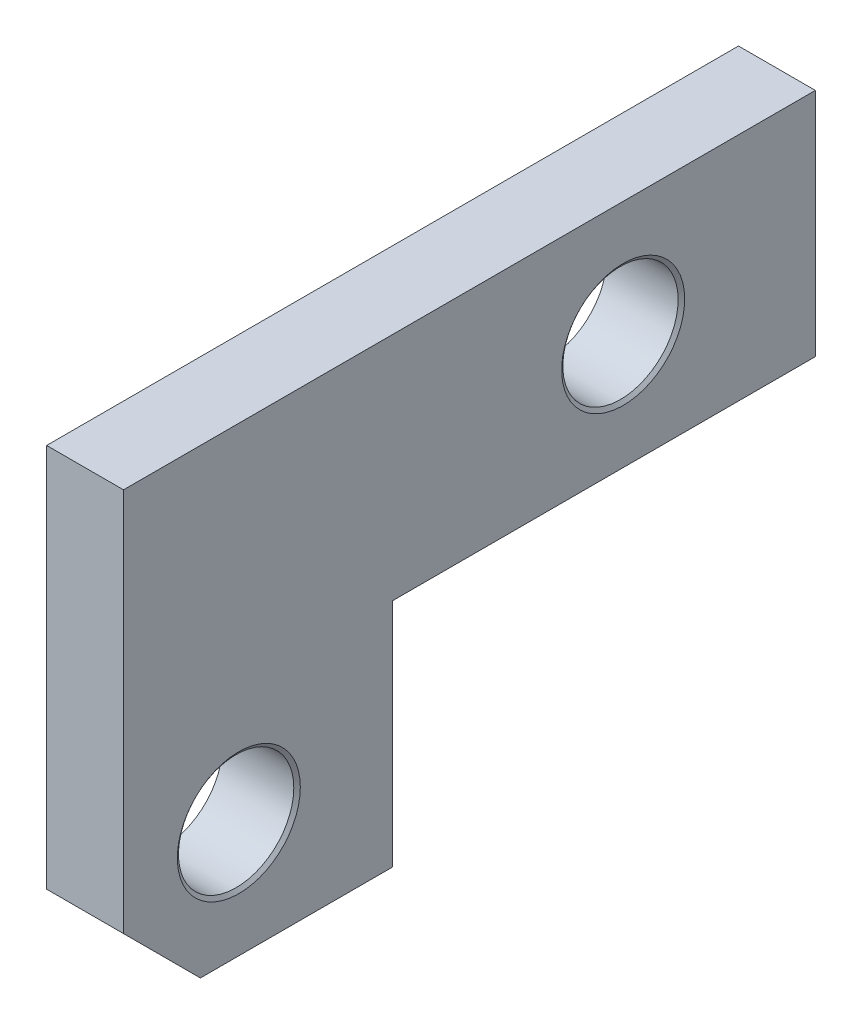
ISO-10303-21;
HEADER;
FILE_DESCRIPTION(('STEP AP214'),'2;1');
FILE_NAME('part.step','',(''),(''),'','','');
FILE_SCHEMA(('AUTOMOTIVE_DESIGN { 1 0 10303 214 1 1 1 1 }'));
ENDSEC;
DATA;
#1=APPLICATION_CONTEXT('core data for automotive mechanical design processes');
#2=APPLICATION_PROTOCOL_DEFINITION('international standard','automotive_design',2000,#1);
#3=PRODUCT_CONTEXT('',#1,'mechanical');
#4=PRODUCT('Part','Part','',(#3));
#5=PRODUCT_RELATED_PRODUCT_CATEGORY('part','',(#4));
#6=PRODUCT_DEFINITION_FORMATION('','',#4);
#7=PRODUCT_DEFINITION_CONTEXT('part definition',#1,'design');
#8=PRODUCT_DEFINITION('design','',#6,#7);
#9=PRODUCT_DEFINITION_SHAPE('','',#8);
#10=(LENGTH_UNIT() NAMED_UNIT(*) SI_UNIT(.MILLI.,.METRE.));
#11=(NAMED_UNIT(*) PLANE_ANGLE_UNIT() SI_UNIT($,.RADIAN.));
#12=(NAMED_UNIT(*) SI_UNIT($,.STERADIAN.) SOLID_ANGLE_UNIT());
#13=UNCERTAINTY_MEASURE_WITH_UNIT(LENGTH_MEASURE(1.E-05),#10,'distance_accuracy_value','');
#14=(GEOMETRIC_REPRESENTATION_CONTEXT(3) GLOBAL_UNCERTAINTY_ASSIGNED_CONTEXT((#13)) GLOBAL_UNIT_ASSIGNED_CONTEXT((#10,
#11,#12)) REPRESENTATION_CONTEXT('',''));
#15=CARTESIAN_POINT('',(0.,0.,0.));
#16=DIRECTION('',(0.,0.,1.));
#17=DIRECTION('',(1.,0.,0.));
#18=AXIS2_PLACEMENT_3D('',#15,#16,#17);
#19=CARTESIAN_POINT('',(2.,0.,2.));
#20=DIRECTION('',(0.,0.,1.));
#21=DIRECTION('',(0.,-1.,0.));
#22=AXIS2_PLACEMENT_3D('',#19,#20,#21);
#23=PLANE('',#22);
#24=DIRECTION('',(0.,1.,0.));
#25=VECTOR('',#24,1.);
#26=CARTESIAN_POINT('',(0.,0.,2.));
#27=LINE('',#26,#25);
#28=CARTESIAN_POINT('',(0.,-6.,2.));
#29=VERTEX_POINT('',#28);
#30=CARTESIAN_POINT('',(0.,0.,2.));
#31=VERTEX_POINT('',#30);
#32=EDGE_CURVE('E111',#29,#31,#27,.T.);
#33=ORIENTED_EDGE('',*,*,#32,.T.);
#34=DIRECTION('',(-1.,0.,0.));
#35=VECTOR('',#34,1.);
#36=CARTESIAN_POINT('',(2.,0.,2.));
#37=LINE('',#36,#35);
#38=CARTESIAN_POINT('',(2.,0.,2.));
#39=VERTEX_POINT('',#38);
#40=EDGE_CURVE('E92',#39,#31,#37,.T.);
#41=ORIENTED_EDGE('',*,*,#40,.F.);
#42=DIRECTION('',(0.,1.,0.));
#43=VECTOR('',#42,1.);
#44=CARTESIAN_POINT('',(2.,0.,2.));
#45=LINE('',#44,#43);
#46=CARTESIAN_POINT('',(2.,-6.,2.));
#47=VERTEX_POINT('',#46);
#48=EDGE_CURVE('E99',#47,#39,#45,.T.);
#49=ORIENTED_EDGE('',*,*,#48,.F.);
#50=DIRECTION('',(-1.,0.,0.));
#51=VECTOR('',#50,1.);
#52=CARTESIAN_POINT('',(2.,-6.,2.));
#53=LINE('',#52,#51);
#54=EDGE_CURVE('E124',#47,#29,#53,.T.);
#55=ORIENTED_EDGE('',*,*,#54,.T.);
#56=EDGE_LOOP('',(#33,#41,#49,#55));
#57=FACE_BOUND('',#56,.T.);
#58=ADVANCED_FACE('F31',(#57),#23,.F.);
#59=CARTESIAN_POINT('',(2.,-1.66533453693773E-13,-16.9681857510935));
#60=DIRECTION('',(0.,1.,0.));
#61=DIRECTION('',(0.,0.,1.));
#62=AXIS2_PLACEMENT_3D('',#59,#60,#61);
#63=PLANE('',#62);
#64=DIRECTION('',(0.,0.,-1.));
#65=VECTOR('',#64,1.);
#66=CARTESIAN_POINT('',(0.,-1.66533453693773E-13,-16.9681857510935));
#67=LINE('',#66,#65);
#68=CARTESIAN_POINT('',(0.,-1.66533453693773E-13,-9.));
#69=VERTEX_POINT('',#68);
#70=EDGE_CURVE('E135',#31,#69,#67,.T.);
#71=ORIENTED_EDGE('',*,*,#70,.T.);
#72=DIRECTION('',(-1.,0.,0.));
#73=VECTOR('',#72,1.);
#74=CARTESIAN_POINT('',(2.,-1.66533453693773E-13,-9.));
#75=LINE('',#74,#73);
#76=CARTESIAN_POINT('',(2.,-1.66533453693773E-13,-9.));
#77=VERTEX_POINT('',#76);
#78=EDGE_CURVE('E95',#77,#69,#75,.T.);
#79=ORIENTED_EDGE('',*,*,#78,.F.);
#80=DIRECTION('',(0.,0.,-1.));
#81=VECTOR('',#80,1.);
#82=CARTESIAN_POINT('',(2.,-1.66533453693773E-13,-16.9681857510935));
#83=LINE('',#82,#81);
#84=EDGE_CURVE('E88',#39,#77,#83,.T.);
#85=ORIENTED_EDGE('',*,*,#84,.F.);
#86=ORIENTED_EDGE('',*,*,#40,.T.);
#87=EDGE_LOOP('',(#71,#79,#85,#86));
#88=FACE_BOUND('',#87,.T.);
#89=ADVANCED_FACE('F90',(#88),#63,.F.);
#90=CARTESIAN_POINT('',(2.,-1.66533453693773E-13,-9.));
#91=DIRECTION('',(0.,0.,1.));
#92=DIRECTION('',(0.,-1.,0.));
#93=AXIS2_PLACEMENT_3D('',#90,#91,#92);
#94=PLANE('',#93);
#95=DIRECTION('',(0.,1.,0.));
#96=VECTOR('',#95,1.);
#97=CARTESIAN_POINT('',(0.,-1.66533453693773E-13,-9.));
#98=LINE('',#97,#96);
#99=CARTESIAN_POINT('',(0.,6.,-9.));
#100=VERTEX_POINT('',#99);
#101=EDGE_CURVE('E132',#69,#100,#98,.T.);
#102=ORIENTED_EDGE('',*,*,#101,.T.);
#103=DIRECTION('',(-1.,0.,0.));
#104=VECTOR('',#103,1.);
#105=CARTESIAN_POINT('',(2.,6.,-9.));
#106=LINE('',#105,#104);
#107=CARTESIAN_POINT('',(2.,6.,-9.));
#108=VERTEX_POINT('',#107);
#109=EDGE_CURVE('E116',#108,#100,#106,.T.);
#110=ORIENTED_EDGE('',*,*,#109,.F.);
#111=DIRECTION('',(0.,1.,0.));
#112=VECTOR('',#111,1.);
#113=CARTESIAN_POINT('',(2.,-1.66533453693773E-13,-9.));
#114=LINE('',#113,#112);
#115=EDGE_CURVE('E98',#77,#108,#114,.T.);
#116=ORIENTED_EDGE('',*,*,#115,.F.);
#117=ORIENTED_EDGE('',*,*,#78,.T.);
#118=EDGE_LOOP('',(#102,#110,#116,#117));
#119=FACE_BOUND('',#118,.T.);
#120=ADVANCED_FACE('F213',(#119),#94,.F.);
#121=CARTESIAN_POINT('',(2.,6.,-16.9681857510935));
#122=DIRECTION('',(0.,1.,0.));
#123=DIRECTION('',(0.,0.,1.));
#124=AXIS2_PLACEMENT_3D('',#121,#122,#123);
#125=PLANE('',#124);
#126=DIRECTION('',(0.,0.,-1.));
#127=VECTOR('',#126,1.);
#128=CARTESIAN_POINT('',(0.,6.,-16.9681857510935));
#129=LINE('',#128,#127);
#130=CARTESIAN_POINT('',(0.,6.,9.));
#131=VERTEX_POINT('',#130);
#132=EDGE_CURVE('E129',#131,#100,#129,.T.);
#133=ORIENTED_EDGE('',*,*,#132,.F.);
#134=DIRECTION('',(-1.,0.,0.));
#135=VECTOR('',#134,1.);
#136=CARTESIAN_POINT('',(2.,6.,9.));
#137=LINE('',#136,#135);
#138=CARTESIAN_POINT('',(2.,6.,9.));
#139=VERTEX_POINT('',#138);
#140=EDGE_CURVE('E121',#139,#131,#137,.T.);
#141=ORIENTED_EDGE('',*,*,#140,.F.);
#142=DIRECTION('',(0.,0.,-1.));
#143=VECTOR('',#142,1.);
#144=CARTESIAN_POINT('',(2.,6.,-16.9681857510935));
#145=LINE('',#144,#143);
#146=EDGE_CURVE('E142',#139,#108,#145,.T.);
#147=ORIENTED_EDGE('',*,*,#146,.T.);
#148=ORIENTED_EDGE('',*,*,#109,.T.);
#149=EDGE_LOOP('',(#133,#141,#147,#148));
#150=FACE_BOUND('',#149,.T.);
#151=ADVANCED_FACE('F218',(#150),#125,.T.);
#152=CARTESIAN_POINT('',(2.,0.,9.));
#153=DIRECTION('',(0.,0.,1.));
#154=DIRECTION('',(0.,-1.,0.));
#155=AXIS2_PLACEMENT_3D('',#152,#153,#154);
#156=PLANE('',#155);
#157=DIRECTION('',(0.,1.,0.));
#158=VECTOR('',#157,1.);
#159=CARTESIAN_POINT('',(0.,0.,9.));
#160=LINE('',#159,#158);
#161=CARTESIAN_POINT('',(0.,-4.00000000000004,8.99999999999997));
#162=VERTEX_POINT('',#161);
#163=EDGE_CURVE('E127',#162,#131,#160,.T.);
#164=ORIENTED_EDGE('',*,*,#163,.F.);
#165=DIRECTION('',(1.,0.,0.));
#166=VECTOR('',#165,1.);
#167=CARTESIAN_POINT('',(2.,-4.00000000000004,8.99999999999997));
#168=LINE('',#167,#166);
#169=CARTESIAN_POINT('',(2.,-4.00000000000003,8.99999999999997));
#170=VERTEX_POINT('',#169);
#171=EDGE_CURVE('E39',#162,#170,#168,.T.);
#172=ORIENTED_EDGE('',*,*,#171,.T.);
#173=DIRECTION('',(0.,1.,0.));
#174=VECTOR('',#173,1.);
#175=CARTESIAN_POINT('',(2.,0.,9.));
#176=LINE('',#175,#174);
#177=EDGE_CURVE('E140',#170,#139,#176,.T.);
#178=ORIENTED_EDGE('',*,*,#177,.T.);
#179=ORIENTED_EDGE('',*,*,#140,.T.);
#180=EDGE_LOOP('',(#164,#172,#178,#179));
#181=FACE_BOUND('',#180,.T.);
#182=ADVANCED_FACE('F222',(#181),#156,.T.);
#183=CARTESIAN_POINT('',(2.,-6.00000000000017,-16.9681857510935));
#184=DIRECTION('',(0.,1.,0.));
#185=DIRECTION('',(0.,0.,1.));
#186=AXIS2_PLACEMENT_3D('',#183,#184,#185);
#187=PLANE('',#186);
#188=DIRECTION('',(0.,0.,-1.));
#189=VECTOR('',#188,1.);
#190=CARTESIAN_POINT('',(2.,-6.00000000000017,-16.9681857510935));
#191=LINE('',#190,#189);
#192=CARTESIAN_POINT('',(2.,-5.99999999999998,7.));
#193=VERTEX_POINT('',#192);
#194=EDGE_CURVE('E104',#193,#47,#191,.T.);
#195=ORIENTED_EDGE('',*,*,#194,.F.);
#196=DIRECTION('',(-1.,0.,0.));
#197=VECTOR('',#196,1.);
#198=CARTESIAN_POINT('',(0.,-5.99999999999998,7.00000000000001));
#199=LINE('',#198,#197);
#200=CARTESIAN_POINT('',(0.,-5.99999999999998,7.));
#201=VERTEX_POINT('',#200);
#202=EDGE_CURVE('E112',#193,#201,#199,.T.);
#203=ORIENTED_EDGE('',*,*,#202,.T.);
#204=DIRECTION('',(0.,0.,-1.));
#205=VECTOR('',#204,1.);
#206=CARTESIAN_POINT('',(0.,-6.00000000000017,-16.9681857510935));
#207=LINE('',#206,#205);
#208=EDGE_CURVE('E108',#201,#29,#207,.T.);
#209=ORIENTED_EDGE('',*,*,#208,.T.);
#210=ORIENTED_EDGE('',*,*,#54,.F.);
#211=EDGE_LOOP('',(#195,#203,#209,#210));
#212=FACE_BOUND('',#211,.T.);
#213=ADVANCED_FACE('F194',(#212),#187,.F.);
#214=CARTESIAN_POINT('',(2.,-1.66533453693773E-13,-16.9681857510935));
#215=DIRECTION('',(1.,0.,0.));
#216=DIRECTION('',(0.,0.,-1.));
#217=AXIS2_PLACEMENT_3D('',#214,#215,#216);
#218=PLANE('',#217);
#219=CARTESIAN_POINT('',(2.,3.,-4.));
#220=DIRECTION('',(1.,0.,0.));
#221=DIRECTION('',(0.,0.,-1.));
#222=AXIS2_PLACEMENT_3D('',#219,#220,#221);
#223=CIRCLE('',#222,1.6);
#224=CARTESIAN_POINT('',(2.,3.,-5.6));
#225=VERTEX_POINT('',#224);
#226=EDGE_CURVE('E163',#225,#225,#223,.T.);
#227=ORIENTED_EDGE('',*,*,#226,.F.);
#228=EDGE_LOOP('',(#227));
#229=FACE_BOUND('',#228,.T.);
#230=CARTESIAN_POINT('',(2.,-3.,6.));
#231=DIRECTION('',(1.,0.,0.));
#232=DIRECTION('',(0.,0.,-1.));
#233=AXIS2_PLACEMENT_3D('',#230,#231,#232);
#234=CIRCLE('',#233,1.6);
#235=CARTESIAN_POINT('',(2.,-3.,4.4));
#236=VERTEX_POINT('',#235);
#237=EDGE_CURVE('E151',#236,#236,#234,.T.);
#238=ORIENTED_EDGE('',*,*,#237,.F.);
#239=EDGE_LOOP('',(#238));
#240=FACE_BOUND('',#239,.T.);
#241=ORIENTED_EDGE('',*,*,#177,.F.);
#242=DIRECTION('',(0.,-0.707106781186543,-0.707106781186552));
#243=VECTOR('',#242,1.);
#244=CARTESIAN_POINT('',(2.,-14.9840928755469,-1.98409287554699));
#245=LINE('',#244,#243);
#246=EDGE_CURVE('E11',#170,#193,#245,.T.);
#247=ORIENTED_EDGE('',*,*,#246,.T.);
#248=ORIENTED_EDGE('',*,*,#194,.T.);
#249=ORIENTED_EDGE('',*,*,#48,.T.);
#250=ORIENTED_EDGE('',*,*,#84,.T.);
#251=ORIENTED_EDGE('',*,*,#115,.T.);
#252=ORIENTED_EDGE('',*,*,#146,.F.);
#253=EDGE_LOOP('',(#241,#247,#248,#249,#250,#251,#252));
#254=FACE_BOUND('',#253,.T.);
#255=ADVANCED_FACE('F102',(#229,#240,#254),#218,.T.);
#256=CARTESIAN_POINT('',(0.,-1.66533453693773E-13,-16.9681857510935));
#257=DIRECTION('',(1.,0.,0.));
#258=DIRECTION('',(0.,0.,-1.));
#259=AXIS2_PLACEMENT_3D('',#256,#257,#258);
#260=PLANE('',#259);
#261=CARTESIAN_POINT('',(0.,3.,-4.));
#262=DIRECTION('',(1.,0.,0.));
#263=DIRECTION('',(0.,0.,-1.));
#264=AXIS2_PLACEMENT_3D('',#261,#262,#263);
#265=CIRCLE('',#264,1.6);
#266=CARTESIAN_POINT('',(0.,3.,-5.6));
#267=VERTEX_POINT('',#266);
#268=EDGE_CURVE('E166',#267,#267,#265,.T.);
#269=ORIENTED_EDGE('',*,*,#268,.T.);
#270=EDGE_LOOP('',(#269));
#271=FACE_BOUND('',#270,.T.);
#272=CARTESIAN_POINT('',(0.,-3.,6.));
#273=DIRECTION('',(1.,0.,0.));
#274=DIRECTION('',(0.,0.,-1.));
#275=AXIS2_PLACEMENT_3D('',#272,#273,#274);
#276=CIRCLE('',#275,1.6);
#277=CARTESIAN_POINT('',(0.,-3.,4.4));
#278=VERTEX_POINT('',#277);
#279=EDGE_CURVE('E154',#278,#278,#276,.T.);
#280=ORIENTED_EDGE('',*,*,#279,.T.);
#281=EDGE_LOOP('',(#280));
#282=FACE_BOUND('',#281,.T.);
#283=ORIENTED_EDGE('',*,*,#208,.F.);
#284=DIRECTION('',(0.,0.707106781186543,0.707106781186552));
#285=VECTOR('',#284,1.);
#286=CARTESIAN_POINT('',(0.,-5.99999999999998,7.00000000000001));
#287=LINE('',#286,#285);
#288=EDGE_CURVE('E53',#201,#162,#287,.T.);
#289=ORIENTED_EDGE('',*,*,#288,.T.);
#290=ORIENTED_EDGE('',*,*,#163,.T.);
#291=ORIENTED_EDGE('',*,*,#132,.T.);
#292=ORIENTED_EDGE('',*,*,#101,.F.);
#293=ORIENTED_EDGE('',*,*,#70,.F.);
#294=ORIENTED_EDGE('',*,*,#32,.F.);
#295=EDGE_LOOP('',(#283,#289,#290,#291,#292,#293,#294));
#296=FACE_BOUND('',#295,.T.);
#297=ADVANCED_FACE('F170',(#271,#282,#296),#260,.F.);
#298=CARTESIAN_POINT('',(0.0700207538209714,-3.,6.));
#299=DIRECTION('',(-1.,0.,0.));
#300=DIRECTION('',(0.,0.,1.));
#301=AXIS2_PLACEMENT_3D('',#298,#299,#300);
#302=CONICAL_SURFACE('',#301,1.5,0.959931088596878);
#303=ORIENTED_EDGE('',*,*,#279,.F.);
#304=EDGE_LOOP('',(#303));
#305=FACE_BOUND('',#304,.T.);
#306=CARTESIAN_POINT('',(0.0700207538209714,-3.,6.));
#307=DIRECTION('',(1.,0.,0.));
#308=DIRECTION('',(0.,0.,-1.));
#309=AXIS2_PLACEMENT_3D('',#306,#307,#308);
#310=CIRCLE('',#309,1.5);
#311=CARTESIAN_POINT('',(0.0700207538209714,-3.,4.5));
#312=VERTEX_POINT('',#311);
#313=EDGE_CURVE('E138',#312,#312,#310,.T.);
#314=ORIENTED_EDGE('',*,*,#313,.T.);
#315=EDGE_LOOP('',(#314));
#316=FACE_BOUND('',#315,.T.);
#317=ADVANCED_FACE('F205',(#305,#316),#302,.F.);
#318=CARTESIAN_POINT('',(2.,-3.,6.));
#319=DIRECTION('',(1.,0.,0.));
#320=DIRECTION('',(0.,0.,-1.));
#321=AXIS2_PLACEMENT_3D('',#318,#319,#320);
#322=CYLINDRICAL_SURFACE('',#321,1.5);
#323=ORIENTED_EDGE('',*,*,#313,.F.);
#324=EDGE_LOOP('',(#323));
#325=FACE_BOUND('',#324,.T.);
#326=CARTESIAN_POINT('',(1.92997924617903,-3.,6.));
#327=DIRECTION('',(1.,0.,0.));
#328=DIRECTION('',(0.,0.,-1.));
#329=AXIS2_PLACEMENT_3D('',#326,#327,#328);
#330=CIRCLE('',#329,1.5);
#331=CARTESIAN_POINT('',(1.92997924617903,-3.,4.5));
#332=VERTEX_POINT('',#331);
#333=EDGE_CURVE('E148',#332,#332,#330,.T.);
#334=ORIENTED_EDGE('',*,*,#333,.T.);
#335=EDGE_LOOP('',(#334));
#336=FACE_BOUND('',#335,.T.);
#337=ADVANCED_FACE('F199',(#325,#336),#322,.F.);
#338=CARTESIAN_POINT('',(2.,-3.,6.));
#339=DIRECTION('',(1.,0.,0.));
#340=DIRECTION('',(0.,0.,-1.));
#341=AXIS2_PLACEMENT_3D('',#338,#339,#340);
#342=CONICAL_SURFACE('',#341,1.6,0.959931088596875);
#343=ORIENTED_EDGE('',*,*,#333,.F.);
#344=EDGE_LOOP('',(#343));
#345=FACE_BOUND('',#344,.T.);
#346=ORIENTED_EDGE('',*,*,#237,.T.);
#347=EDGE_LOOP('',(#346));
#348=FACE_BOUND('',#347,.T.);
#349=ADVANCED_FACE('F177',(#345,#348),#342,.F.);
#350=CARTESIAN_POINT('',(0.0700207538209714,3.,-4.));
#351=DIRECTION('',(-1.,0.,0.));
#352=DIRECTION('',(0.,0.,1.));
#353=AXIS2_PLACEMENT_3D('',#350,#351,#352);
#354=CONICAL_SURFACE('',#353,1.5,0.959931088596879);
#355=ORIENTED_EDGE('',*,*,#268,.F.);
#356=EDGE_LOOP('',(#355));
#357=FACE_BOUND('',#356,.T.);
#358=CARTESIAN_POINT('',(0.0700207538209714,3.,-4.));
#359=DIRECTION('',(1.,0.,0.));
#360=DIRECTION('',(0.,0.,-1.));
#361=AXIS2_PLACEMENT_3D('',#358,#359,#360);
#362=CIRCLE('',#361,1.5);
#363=CARTESIAN_POINT('',(0.0700207538209714,3.,-5.5));
#364=VERTEX_POINT('',#363);
#365=EDGE_CURVE('E157',#364,#364,#362,.T.);
#366=ORIENTED_EDGE('',*,*,#365,.T.);
#367=EDGE_LOOP('',(#366));
#368=FACE_BOUND('',#367,.T.);
#369=ADVANCED_FACE('F173',(#357,#368),#354,.F.);
#370=CARTESIAN_POINT('',(2.,3.,-4.));
#371=DIRECTION('',(1.,0.,0.));
#372=DIRECTION('',(0.,0.,-1.));
#373=AXIS2_PLACEMENT_3D('',#370,#371,#372);
#374=CYLINDRICAL_SURFACE('',#373,1.5);
#375=ORIENTED_EDGE('',*,*,#365,.F.);
#376=EDGE_LOOP('',(#375));
#377=FACE_BOUND('',#376,.T.);
#378=CARTESIAN_POINT('',(1.92997924617903,3.,-4.));
#379=DIRECTION('',(1.,0.,0.));
#380=DIRECTION('',(0.,0.,-1.));
#381=AXIS2_PLACEMENT_3D('',#378,#379,#380);
#382=CIRCLE('',#381,1.5);
#383=CARTESIAN_POINT('',(1.92997924617903,3.,-5.5));
#384=VERTEX_POINT('',#383);
#385=EDGE_CURVE('E160',#384,#384,#382,.T.);
#386=ORIENTED_EDGE('',*,*,#385,.T.);
#387=EDGE_LOOP('',(#386));
#388=FACE_BOUND('',#387,.T.);
#389=ADVANCED_FACE('F176',(#377,#388),#374,.F.);
#390=CARTESIAN_POINT('',(2.,3.,-4.));
#391=DIRECTION('',(1.,0.,0.));
#392=DIRECTION('',(0.,0.,-1.));
#393=AXIS2_PLACEMENT_3D('',#390,#391,#392);
#394=CONICAL_SURFACE('',#393,1.6,0.959931088596876);
#395=ORIENTED_EDGE('',*,*,#385,.F.);
#396=EDGE_LOOP('',(#395));
#397=FACE_BOUND('',#396,.T.);
#398=ORIENTED_EDGE('',*,*,#226,.T.);
#399=EDGE_LOOP('',(#398));
#400=FACE_BOUND('',#399,.T.);
#401=ADVANCED_FACE('F183',(#397,#400),#394,.F.);
#402=CARTESIAN_POINT('',(2.,-5.99999999999998,7.00000000000001));
#403=DIRECTION('',(0.,-0.707106781186552,0.707106781186543));
#404=DIRECTION('',(0.,-0.707106781186543,-0.707106781186552));
#405=AXIS2_PLACEMENT_3D('',#402,#403,#404);
#406=PLANE('',#405);
#407=ORIENTED_EDGE('',*,*,#246,.F.);
#408=ORIENTED_EDGE('',*,*,#171,.F.);
#409=ORIENTED_EDGE('',*,*,#288,.F.);
#410=ORIENTED_EDGE('',*,*,#202,.F.);
#411=EDGE_LOOP('',(#407,#408,#409,#410));
#412=FACE_BOUND('',#411,.T.);
#413=ADVANCED_FACE('F33',(#412),#406,.T.);
#414=CLOSED_SHELL('',(#58,#89,#120,#151,#182,#213,#255,#297,#317,#337,#349,#369,#389,#401,#413));
#415=MANIFOLD_SOLID_BREP('B2',#414);
#416=ADVANCED_BREP_SHAPE_REPRESENTATION('',(#18,#415),#14);
#417=SHAPE_DEFINITION_REPRESENTATION(#9,#416);
ENDSEC;
END-ISO-10303-21;
